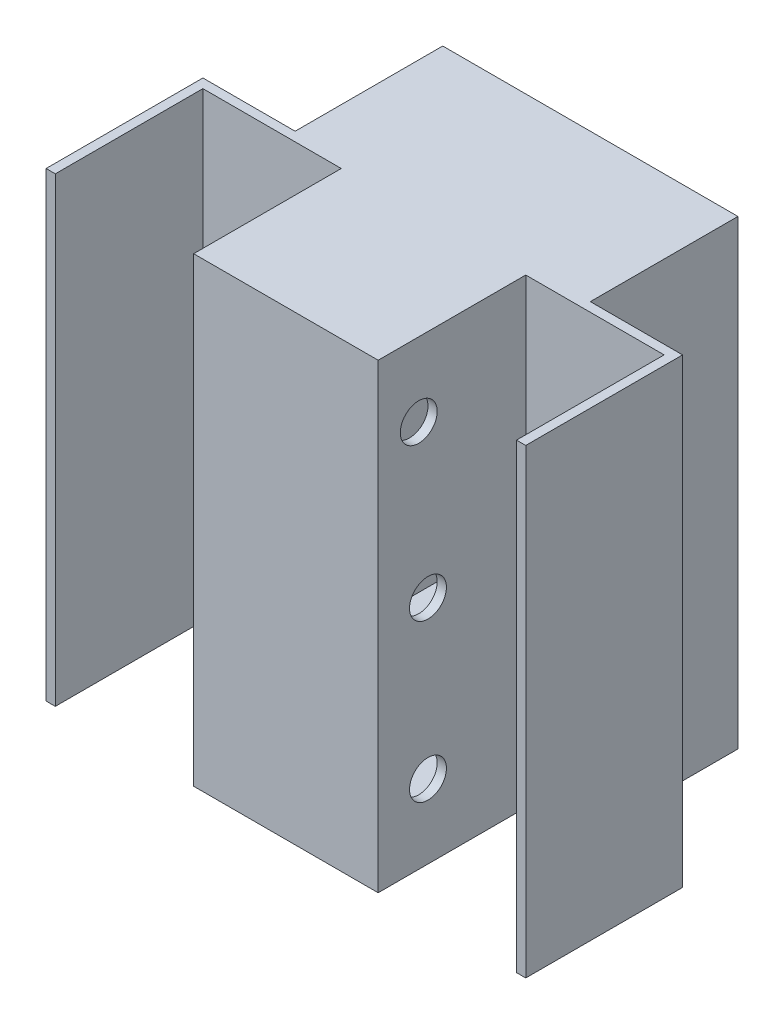
ISO-10303-21;
HEADER;
FILE_DESCRIPTION(('STEP AP214'),'2;1');
FILE_NAME('part.step','',(''),(''),'','','');
FILE_SCHEMA(('AUTOMOTIVE_DESIGN { 1 0 10303 214 1 1 1 1 }'));
ENDSEC;
DATA;
#1=APPLICATION_CONTEXT('core data for automotive mechanical design processes');
#2=APPLICATION_PROTOCOL_DEFINITION('international standard','automotive_design',2000,#1);
#3=PRODUCT_CONTEXT('',#1,'mechanical');
#4=PRODUCT('Part','Part','',(#3));
#5=PRODUCT_RELATED_PRODUCT_CATEGORY('part','',(#4));
#6=PRODUCT_DEFINITION_FORMATION('','',#4);
#7=PRODUCT_DEFINITION_CONTEXT('part definition',#1,'design');
#8=PRODUCT_DEFINITION('design','',#6,#7);
#9=PRODUCT_DEFINITION_SHAPE('','',#8);
#10=(LENGTH_UNIT() NAMED_UNIT(*) SI_UNIT(.MILLI.,.METRE.));
#11=(NAMED_UNIT(*) PLANE_ANGLE_UNIT() SI_UNIT($,.RADIAN.));
#12=(NAMED_UNIT(*) SI_UNIT($,.STERADIAN.) SOLID_ANGLE_UNIT());
#13=UNCERTAINTY_MEASURE_WITH_UNIT(LENGTH_MEASURE(1.E-05),#10,'distance_accuracy_value','');
#14=(GEOMETRIC_REPRESENTATION_CONTEXT(3) GLOBAL_UNCERTAINTY_ASSIGNED_CONTEXT((#13)) GLOBAL_UNIT_ASSIGNED_CONTEXT((#10,
#11,#12)) REPRESENTATION_CONTEXT('',''));
#15=CARTESIAN_POINT('',(0.,0.,0.));
#16=DIRECTION('',(0.,0.,1.));
#17=DIRECTION('',(1.,0.,0.));
#18=AXIS2_PLACEMENT_3D('',#15,#16,#17);
#19=CARTESIAN_POINT('',(-90.,0.,0.));
#20=DIRECTION('',(-1.,0.,0.));
#21=DIRECTION('',(0.,0.,-1.));
#22=AXIS2_PLACEMENT_3D('',#19,#20,#21);
#23=PLANE('',#22);
#24=CARTESIAN_POINT('',(-90.,210.,-17.));
#25=DIRECTION('',(1.,0.,0.));
#26=DIRECTION('',(0.,0.,-1.));
#27=AXIS2_PLACEMENT_3D('',#24,#25,#26);
#28=CIRCLE('',#27,10.);
#29=CARTESIAN_POINT('',(-90.,210.,-27.));
#30=VERTEX_POINT('',#29);
#31=EDGE_CURVE('E278',#30,#30,#28,.T.);
#32=ORIENTED_EDGE('',*,*,#31,.F.);
#33=EDGE_LOOP('',(#32));
#34=FACE_BOUND('',#33,.T.);
#35=CARTESIAN_POINT('',(-90.,40.,-22.));
#36=DIRECTION('',(1.,0.,0.));
#37=DIRECTION('',(0.,0.,-1.));
#38=AXIS2_PLACEMENT_3D('',#35,#36,#37);
#39=CIRCLE('',#38,10.);
#40=CARTESIAN_POINT('',(-90.,40.,-32.));
#41=VERTEX_POINT('',#40);
#42=EDGE_CURVE('E290',#41,#41,#39,.T.);
#43=ORIENTED_EDGE('',*,*,#42,.F.);
#44=EDGE_LOOP('',(#43));
#45=FACE_BOUND('',#44,.T.);
#46=CARTESIAN_POINT('',(-90.,125.,-22.));
#47=DIRECTION('',(1.,0.,0.));
#48=DIRECTION('',(0.,0.,-1.));
#49=AXIS2_PLACEMENT_3D('',#46,#47,#48);
#50=CIRCLE('',#49,10.);
#51=CARTESIAN_POINT('',(-90.,125.,-32.));
#52=VERTEX_POINT('',#51);
#53=EDGE_CURVE('E284',#52,#52,#50,.T.);
#54=ORIENTED_EDGE('',*,*,#53,.F.);
#55=EDGE_LOOP('',(#54));
#56=FACE_BOUND('',#55,.T.);
#57=DIRECTION('',(0.,1.,0.));
#58=VECTOR('',#57,1.);
#59=CARTESIAN_POINT('',(-90.,250.,-80.));
#60=LINE('',#59,#58);
#61=CARTESIAN_POINT('',(-90.,5.,-80.));
#62=VERTEX_POINT('',#61);
#63=CARTESIAN_POINT('',(-90.,245.,-80.));
#64=VERTEX_POINT('',#63);
#65=EDGE_CURVE('E269',#62,#64,#60,.T.);
#66=ORIENTED_EDGE('',*,*,#65,.T.);
#67=DIRECTION('',(0.,0.,1.));
#68=VECTOR('',#67,1.);
#69=CARTESIAN_POINT('',(-90.,245.,-80.));
#70=LINE('',#69,#68);
#71=CARTESIAN_POINT('',(-90.,245.,0.));
#72=VERTEX_POINT('',#71);
#73=EDGE_CURVE('E52',#64,#72,#70,.T.);
#74=ORIENTED_EDGE('',*,*,#73,.T.);
#75=DIRECTION('',(0.,1.,0.));
#76=VECTOR('',#75,1.);
#77=CARTESIAN_POINT('',(-90.,0.,0.));
#78=LINE('',#77,#76);
#79=CARTESIAN_POINT('',(-90.,5.,0.));
#80=VERTEX_POINT('',#79);
#81=EDGE_CURVE('E387',#80,#72,#78,.T.);
#82=ORIENTED_EDGE('',*,*,#81,.F.);
#83=DIRECTION('',(0.,0.,-1.));
#84=VECTOR('',#83,1.);
#85=CARTESIAN_POINT('',(-90.,5.,0.));
#86=LINE('',#85,#84);
#87=EDGE_CURVE('E251',#80,#62,#86,.T.);
#88=ORIENTED_EDGE('',*,*,#87,.T.);
#89=EDGE_LOOP('',(#66,#74,#82,#88));
#90=FACE_BOUND('',#89,.T.);
#91=ADVANCED_FACE('F35',(#34,#45,#56,#90),#23,.F.);
#92=CARTESIAN_POINT('',(0.,0.,-80.));
#93=DIRECTION('',(0.,0.,1.));
#94=DIRECTION('',(0.,-1.,0.));
#95=AXIS2_PLACEMENT_3D('',#92,#93,#94);
#96=PLANE('',#95);
#97=DIRECTION('',(0.,1.,0.));
#98=VECTOR('',#97,1.);
#99=CARTESIAN_POINT('',(0.,250.,-80.));
#100=LINE('',#99,#98);
#101=CARTESIAN_POINT('',(0.,5.,-80.));
#102=VERTEX_POINT('',#101);
#103=CARTESIAN_POINT('',(0.,245.,-80.));
#104=VERTEX_POINT('',#103);
#105=EDGE_CURVE('E401',#102,#104,#100,.T.);
#106=ORIENTED_EDGE('',*,*,#105,.T.);
#107=DIRECTION('',(1.,0.,0.));
#108=VECTOR('',#107,1.);
#109=CARTESIAN_POINT('',(0.,245.,-80.));
#110=LINE('',#109,#108);
#111=CARTESIAN_POINT('',(30.,245.,-80.));
#112=VERTEX_POINT('',#111);
#113=EDGE_CURVE('E360',#104,#112,#110,.T.);
#114=ORIENTED_EDGE('',*,*,#113,.T.);
#115=DIRECTION('',(0.,1.,0.));
#116=VECTOR('',#115,1.);
#117=CARTESIAN_POINT('',(30.,250.,-80.));
#118=LINE('',#117,#116);
#119=CARTESIAN_POINT('',(30.,5.,-80.));
#120=VERTEX_POINT('',#119);
#121=EDGE_CURVE('E393',#120,#112,#118,.T.);
#122=ORIENTED_EDGE('',*,*,#121,.F.);
#123=DIRECTION('',(-1.,0.,0.));
#124=VECTOR('',#123,1.);
#125=CARTESIAN_POINT('',(30.,5.00000000000001,-80.));
#126=LINE('',#125,#124);
#127=EDGE_CURVE('E233',#120,#102,#126,.T.);
#128=ORIENTED_EDGE('',*,*,#127,.T.);
#129=EDGE_LOOP('',(#106,#114,#122,#128));
#130=FACE_BOUND('',#129,.T.);
#131=ADVANCED_FACE('F515',(#130),#96,.F.);
#132=CARTESIAN_POINT('',(0.,0.,0.));
#133=DIRECTION('',(0.,0.,1.));
#134=DIRECTION('',(1.,0.,0.));
#135=AXIS2_PLACEMENT_3D('',#132,#133,#134);
#136=PLANE('',#135);
#137=ORIENTED_EDGE('',*,*,#81,.T.);
#138=DIRECTION('',(1.,0.,0.));
#139=VECTOR('',#138,1.);
#140=CARTESIAN_POINT('',(-90.,245.,0.));
#141=LINE('',#140,#139);
#142=CARTESIAN_POINT('',(0.,245.,0.));
#143=VERTEX_POINT('',#142);
#144=EDGE_CURVE('E347',#72,#143,#141,.T.);
#145=ORIENTED_EDGE('',*,*,#144,.T.);
#146=DIRECTION('',(0.,1.,0.));
#147=VECTOR('',#146,1.);
#148=CARTESIAN_POINT('',(0.,0.,0.));
#149=LINE('',#148,#147);
#150=CARTESIAN_POINT('',(0.,5.,0.));
#151=VERTEX_POINT('',#150);
#152=EDGE_CURVE('E388',#151,#143,#149,.T.);
#153=ORIENTED_EDGE('',*,*,#152,.F.);
#154=DIRECTION('',(-1.,0.,0.));
#155=VECTOR('',#154,1.);
#156=CARTESIAN_POINT('',(0.,5.,0.));
#157=LINE('',#156,#155);
#158=EDGE_CURVE('E247',#151,#80,#157,.T.);
#159=ORIENTED_EDGE('',*,*,#158,.T.);
#160=EDGE_LOOP('',(#137,#145,#153,#159));
#161=FACE_BOUND('',#160,.T.);
#162=ADVANCED_FACE('F386',(#161),#136,.F.);
#163=CARTESIAN_POINT('',(0.,0.,0.));
#164=DIRECTION('',(1.,0.,0.));
#165=DIRECTION('',(0.,0.,-1.));
#166=AXIS2_PLACEMENT_3D('',#163,#164,#165);
#167=PLANE('',#166);
#168=CARTESIAN_POINT('',(0.,40.,-22.));
#169=DIRECTION('',(1.,0.,0.));
#170=DIRECTION('',(0.,0.,-1.));
#171=AXIS2_PLACEMENT_3D('',#168,#169,#170);
#172=CIRCLE('',#171,10.);
#173=CARTESIAN_POINT('',(0.,40.,-32.));
#174=VERTEX_POINT('',#173);
#175=EDGE_CURVE('E436',#174,#174,#172,.T.);
#176=ORIENTED_EDGE('',*,*,#175,.T.);
#177=EDGE_LOOP('',(#176));
#178=FACE_BOUND('',#177,.T.);
#179=CARTESIAN_POINT('',(0.,125.,-22.));
#180=DIRECTION('',(1.,0.,0.));
#181=DIRECTION('',(0.,0.,-1.));
#182=AXIS2_PLACEMENT_3D('',#179,#180,#181);
#183=CIRCLE('',#182,10.);
#184=CARTESIAN_POINT('',(0.,125.,-32.));
#185=VERTEX_POINT('',#184);
#186=EDGE_CURVE('E430',#185,#185,#183,.T.);
#187=ORIENTED_EDGE('',*,*,#186,.T.);
#188=EDGE_LOOP('',(#187));
#189=FACE_BOUND('',#188,.T.);
#190=CARTESIAN_POINT('',(0.,210.,-17.));
#191=DIRECTION('',(1.,0.,0.));
#192=DIRECTION('',(0.,0.,-1.));
#193=AXIS2_PLACEMENT_3D('',#190,#191,#192);
#194=CIRCLE('',#193,10.);
#195=CARTESIAN_POINT('',(0.,210.,-27.));
#196=VERTEX_POINT('',#195);
#197=EDGE_CURVE('E422',#196,#196,#194,.T.);
#198=ORIENTED_EDGE('',*,*,#197,.T.);
#199=EDGE_LOOP('',(#198));
#200=FACE_BOUND('',#199,.T.);
#201=ORIENTED_EDGE('',*,*,#152,.T.);
#202=DIRECTION('',(0.,0.,-1.));
#203=VECTOR('',#202,1.);
#204=CARTESIAN_POINT('',(0.,245.,0.));
#205=LINE('',#204,#203);
#206=EDGE_CURVE('E60',#143,#104,#205,.T.);
#207=ORIENTED_EDGE('',*,*,#206,.T.);
#208=ORIENTED_EDGE('',*,*,#105,.F.);
#209=DIRECTION('',(0.,0.,1.));
#210=VECTOR('',#209,1.);
#211=CARTESIAN_POINT('',(0.,5.00000000000001,-80.));
#212=LINE('',#211,#210);
#213=EDGE_CURVE('E243',#102,#151,#212,.T.);
#214=ORIENTED_EDGE('',*,*,#213,.T.);
#215=EDGE_LOOP('',(#201,#207,#208,#214));
#216=FACE_BOUND('',#215,.T.);
#217=ADVANCED_FACE('F530',(#178,#189,#200,#216),#167,.F.);
#218=CARTESIAN_POINT('',(30.,250.,-160.));
#219=DIRECTION('',(1.,0.,0.));
#220=DIRECTION('',(0.,1.,0.));
#221=AXIS2_PLACEMENT_3D('',#218,#219,#220);
#222=PLANE('',#221);
#223=ORIENTED_EDGE('',*,*,#121,.T.);
#224=DIRECTION('',(0.,0.,-1.));
#225=VECTOR('',#224,1.);
#226=CARTESIAN_POINT('',(30.,245.,-80.));
#227=LINE('',#226,#225);
#228=CARTESIAN_POINT('',(30.,245.,-160.));
#229=VERTEX_POINT('',#228);
#230=EDGE_CURVE('E364',#112,#229,#227,.T.);
#231=ORIENTED_EDGE('',*,*,#230,.T.);
#232=DIRECTION('',(0.,1.,0.));
#233=VECTOR('',#232,1.);
#234=CARTESIAN_POINT('',(30.,250.,-160.));
#235=LINE('',#234,#233);
#236=CARTESIAN_POINT('',(30.,5.,-160.));
#237=VERTEX_POINT('',#236);
#238=EDGE_CURVE('E416',#237,#229,#235,.T.);
#239=ORIENTED_EDGE('',*,*,#238,.F.);
#240=DIRECTION('',(0.,0.,1.));
#241=VECTOR('',#240,1.);
#242=CARTESIAN_POINT('',(30.,5.,-160.));
#243=LINE('',#242,#241);
#244=EDGE_CURVE('E228',#237,#120,#243,.T.);
#245=ORIENTED_EDGE('',*,*,#244,.T.);
#246=EDGE_LOOP('',(#223,#231,#239,#245));
#247=FACE_BOUND('',#246,.T.);
#248=ADVANCED_FACE('F527',(#247),#222,.F.);
#249=CARTESIAN_POINT('',(-90.,0.,-80.));
#250=DIRECTION('',(0.,0.,1.));
#251=DIRECTION('',(0.,-1.,0.));
#252=AXIS2_PLACEMENT_3D('',#249,#250,#251);
#253=PLANE('',#252);
#254=DIRECTION('',(0.,1.,0.));
#255=VECTOR('',#254,1.);
#256=CARTESIAN_POINT('',(-120.,250.,-80.));
#257=LINE('',#256,#255);
#258=CARTESIAN_POINT('',(-120.,5.,-80.));
#259=VERTEX_POINT('',#258);
#260=CARTESIAN_POINT('',(-120.,245.,-80.));
#261=VERTEX_POINT('',#260);
#262=EDGE_CURVE('E221',#259,#261,#257,.T.);
#263=ORIENTED_EDGE('',*,*,#262,.T.);
#264=DIRECTION('',(1.,0.,0.));
#265=VECTOR('',#264,1.);
#266=CARTESIAN_POINT('',(-120.,245.,-80.));
#267=LINE('',#266,#265);
#268=EDGE_CURVE('E346',#261,#64,#267,.T.);
#269=ORIENTED_EDGE('',*,*,#268,.T.);
#270=ORIENTED_EDGE('',*,*,#65,.F.);
#271=DIRECTION('',(-1.,0.,0.));
#272=VECTOR('',#271,1.);
#273=CARTESIAN_POINT('',(-90.,5.00000000000001,-80.));
#274=LINE('',#273,#272);
#275=EDGE_CURVE('E224',#62,#259,#274,.T.);
#276=ORIENTED_EDGE('',*,*,#275,.T.);
#277=EDGE_LOOP('',(#263,#269,#270,#276));
#278=FACE_BOUND('',#277,.T.);
#279=ADVANCED_FACE('F381',(#278),#253,.F.);
#280=CARTESIAN_POINT('',(-120.,250.,-160.));
#281=DIRECTION('',(1.,0.,0.));
#282=DIRECTION('',(0.,1.,0.));
#283=AXIS2_PLACEMENT_3D('',#280,#281,#282);
#284=PLANE('',#283);
#285=DIRECTION('',(0.,0.,1.));
#286=VECTOR('',#285,1.);
#287=CARTESIAN_POINT('',(-120.,245.,-160.));
#288=LINE('',#287,#286);
#289=CARTESIAN_POINT('',(-120.,245.,-160.));
#290=VERTEX_POINT('',#289);
#291=EDGE_CURVE('E349',#290,#261,#288,.T.);
#292=ORIENTED_EDGE('',*,*,#291,.T.);
#293=ORIENTED_EDGE('',*,*,#262,.F.);
#294=DIRECTION('',(0.,0.,-1.));
#295=VECTOR('',#294,1.);
#296=CARTESIAN_POINT('',(-120.,5.00000000000001,-80.));
#297=LINE('',#296,#295);
#298=CARTESIAN_POINT('',(-120.,5.,-160.));
#299=VERTEX_POINT('',#298);
#300=EDGE_CURVE('E218',#259,#299,#297,.T.);
#301=ORIENTED_EDGE('',*,*,#300,.T.);
#302=DIRECTION('',(0.,1.,0.));
#303=VECTOR('',#302,1.);
#304=CARTESIAN_POINT('',(-120.,250.,-160.));
#305=LINE('',#304,#303);
#306=EDGE_CURVE('E201',#299,#290,#305,.T.);
#307=ORIENTED_EDGE('',*,*,#306,.T.);
#308=EDGE_LOOP('',(#292,#293,#301,#307));
#309=FACE_BOUND('',#308,.T.);
#310=ADVANCED_FACE('F219',(#309),#284,.T.);
#311=DIRECTION('',(-1.,0.,0.));
#312=VECTOR('',#311,1.);
#313=CARTESIAN_POINT('',(-90.,250.,-80.));
#314=LINE('',#313,#312);
#315=CARTESIAN_POINT('',(-125.,250.,-80.));
#316=VERTEX_POINT('',#315);
#317=CARTESIAN_POINT('',(-175.,250.,-80.));
#318=VERTEX_POINT('',#317);
#319=EDGE_CURVE('E322',#316,#318,#314,.T.);
#320=ORIENTED_EDGE('',*,*,#319,.F.);
#321=DIRECTION('',(0.,-1.,0.));
#322=VECTOR('',#321,1.);
#323=CARTESIAN_POINT('',(-125.,250.,-80.));
#324=LINE('',#323,#322);
#325=CARTESIAN_POINT('',(-125.,0.,-80.));
#326=VERTEX_POINT('',#325);
#327=EDGE_CURVE('E229',#316,#326,#324,.T.);
#328=ORIENTED_EDGE('',*,*,#327,.T.);
#329=DIRECTION('',(1.,0.,0.));
#330=VECTOR('',#329,1.);
#331=CARTESIAN_POINT('',(-90.,0.,-80.));
#332=LINE('',#331,#330);
#333=CARTESIAN_POINT('',(-175.,0.,-80.));
#334=VERTEX_POINT('',#333);
#335=EDGE_CURVE('E319',#334,#326,#332,.T.);
#336=ORIENTED_EDGE('',*,*,#335,.F.);
#337=DIRECTION('',(0.,1.,0.));
#338=VECTOR('',#337,1.);
#339=CARTESIAN_POINT('',(-175.,250.,-80.));
#340=LINE('',#339,#338);
#341=EDGE_CURVE('E296',#334,#318,#340,.T.);
#342=ORIENTED_EDGE('',*,*,#341,.T.);
#343=EDGE_LOOP('',(#320,#328,#336,#342));
#344=FACE_BOUND('',#343,.T.);
#345=ADVANCED_FACE('F649',(#344),#253,.F.);
#346=CARTESIAN_POINT('',(-95.,0.,0.));
#347=DIRECTION('',(-1.,0.,0.));
#348=DIRECTION('',(0.,0.,-1.));
#349=AXIS2_PLACEMENT_3D('',#346,#347,#348);
#350=PLANE('',#349);
#351=CARTESIAN_POINT('',(-95.,125.,-22.));
#352=DIRECTION('',(1.,0.,0.));
#353=DIRECTION('',(0.,0.,-1.));
#354=AXIS2_PLACEMENT_3D('',#351,#352,#353);
#355=CIRCLE('',#354,10.);
#356=CARTESIAN_POINT('',(-95.,125.,-32.));
#357=VERTEX_POINT('',#356);
#358=EDGE_CURVE('E281',#357,#357,#355,.T.);
#359=ORIENTED_EDGE('',*,*,#358,.T.);
#360=EDGE_LOOP('',(#359));
#361=FACE_BOUND('',#360,.T.);
#362=DIRECTION('',(0.,-1.,0.));
#363=VECTOR('',#362,1.);
#364=CARTESIAN_POINT('',(-95.,250.,5.));
#365=LINE('',#364,#363);
#366=CARTESIAN_POINT('',(-95.,250.,5.));
#367=VERTEX_POINT('',#366);
#368=CARTESIAN_POINT('',(-95.,0.,5.));
#369=VERTEX_POINT('',#368);
#370=EDGE_CURVE('E324',#367,#369,#365,.T.);
#371=ORIENTED_EDGE('',*,*,#370,.F.);
#372=DIRECTION('',(0.,0.,1.));
#373=VECTOR('',#372,1.);
#374=CARTESIAN_POINT('',(-95.,250.,5.));
#375=LINE('',#374,#373);
#376=CARTESIAN_POINT('',(-95.,250.,-75.));
#377=VERTEX_POINT('',#376);
#378=EDGE_CURVE('E646',#377,#367,#375,.T.);
#379=ORIENTED_EDGE('',*,*,#378,.F.);
#380=DIRECTION('',(0.,1.,0.));
#381=VECTOR('',#380,1.);
#382=CARTESIAN_POINT('',(-95.,250.,-75.));
#383=LINE('',#382,#381);
#384=CARTESIAN_POINT('',(-95.,0.,-75.));
#385=VERTEX_POINT('',#384);
#386=EDGE_CURVE('E396',#385,#377,#383,.T.);
#387=ORIENTED_EDGE('',*,*,#386,.F.);
#388=DIRECTION('',(0.,0.,-1.));
#389=VECTOR('',#388,1.);
#390=CARTESIAN_POINT('',(-95.,0.,5.));
#391=LINE('',#390,#389);
#392=EDGE_CURVE('E390',#369,#385,#391,.T.);
#393=ORIENTED_EDGE('',*,*,#392,.F.);
#394=EDGE_LOOP('',(#371,#379,#387,#393));
#395=FACE_BOUND('',#394,.T.);
#396=CARTESIAN_POINT('',(-95.,40.,-22.));
#397=DIRECTION('',(1.,0.,0.));
#398=DIRECTION('',(0.,0.,-1.));
#399=AXIS2_PLACEMENT_3D('',#396,#397,#398);
#400=CIRCLE('',#399,10.);
#401=CARTESIAN_POINT('',(-95.,40.,-32.));
#402=VERTEX_POINT('',#401);
#403=EDGE_CURVE('E287',#402,#402,#400,.T.);
#404=ORIENTED_EDGE('',*,*,#403,.T.);
#405=EDGE_LOOP('',(#404));
#406=FACE_BOUND('',#405,.T.);
#407=CARTESIAN_POINT('',(-95.,210.,-17.));
#408=DIRECTION('',(1.,0.,0.));
#409=DIRECTION('',(0.,0.,-1.));
#410=AXIS2_PLACEMENT_3D('',#407,#408,#409);
#411=CIRCLE('',#410,10.);
#412=CARTESIAN_POINT('',(-95.,210.,-27.));
#413=VERTEX_POINT('',#412);
#414=EDGE_CURVE('E277',#413,#413,#411,.T.);
#415=ORIENTED_EDGE('',*,*,#414,.T.);
#416=EDGE_LOOP('',(#415));
#417=FACE_BOUND('',#416,.T.);
#418=ADVANCED_FACE('F525',(#361,#395,#406,#417),#350,.T.);
#419=DIRECTION('',(0.,-1.,0.));
#420=VECTOR('',#419,1.);
#421=CARTESIAN_POINT('',(35.,250.,-80.));
#422=LINE('',#421,#420);
#423=CARTESIAN_POINT('',(35.,250.,-80.));
#424=VERTEX_POINT('',#423);
#425=CARTESIAN_POINT('',(35.,0.,-80.));
#426=VERTEX_POINT('',#425);
#427=EDGE_CURVE('E389',#424,#426,#422,.T.);
#428=ORIENTED_EDGE('',*,*,#427,.F.);
#429=DIRECTION('',(1.,0.,0.));
#430=VECTOR('',#429,1.);
#431=CARTESIAN_POINT('',(0.,250.,-80.));
#432=LINE('',#431,#430);
#433=CARTESIAN_POINT('',(85.,250.,-80.));
#434=VERTEX_POINT('',#433);
#435=EDGE_CURVE('E468',#424,#434,#432,.T.);
#436=ORIENTED_EDGE('',*,*,#435,.T.);
#437=DIRECTION('',(0.,1.,0.));
#438=VECTOR('',#437,1.);
#439=CARTESIAN_POINT('',(85.,250.,-80.));
#440=LINE('',#439,#438);
#441=CARTESIAN_POINT('',(85.,0.,-80.));
#442=VERTEX_POINT('',#441);
#443=EDGE_CURVE('E442',#442,#434,#440,.T.);
#444=ORIENTED_EDGE('',*,*,#443,.F.);
#445=DIRECTION('',(-1.,0.,0.));
#446=VECTOR('',#445,1.);
#447=CARTESIAN_POINT('',(0.,0.,-80.));
#448=LINE('',#447,#446);
#449=EDGE_CURVE('E471',#442,#426,#448,.T.);
#450=ORIENTED_EDGE('',*,*,#449,.T.);
#451=EDGE_LOOP('',(#428,#436,#444,#450));
#452=FACE_BOUND('',#451,.T.);
#453=ADVANCED_FACE('F522',(#452),#96,.F.);
#454=CARTESIAN_POINT('',(0.,250.,5.));
#455=DIRECTION('',(0.,-1.,0.));
#456=DIRECTION('',(0.,0.,-1.));
#457=AXIS2_PLACEMENT_3D('',#454,#455,#456);
#458=PLANE('',#457);
#459=DIRECTION('',(1.,0.,0.));
#460=VECTOR('',#459,1.);
#461=CARTESIAN_POINT('',(35.,250.,-160.));
#462=LINE('',#461,#460);
#463=CARTESIAN_POINT('',(-125.,250.,-160.));
#464=VERTEX_POINT('',#463);
#465=CARTESIAN_POINT('',(35.,250.,-160.));
#466=VERTEX_POINT('',#465);
#467=EDGE_CURVE('E418',#464,#466,#462,.T.);
#468=ORIENTED_EDGE('',*,*,#467,.F.);
#469=DIRECTION('',(0.,0.,1.));
#470=VECTOR('',#469,1.);
#471=CARTESIAN_POINT('',(-125.,250.,-160.));
#472=LINE('',#471,#470);
#473=EDGE_CURVE('E275',#464,#316,#472,.T.);
#474=ORIENTED_EDGE('',*,*,#473,.T.);
#475=ORIENTED_EDGE('',*,*,#319,.T.);
#476=DIRECTION('',(0.,0.,1.));
#477=VECTOR('',#476,1.);
#478=CARTESIAN_POINT('',(-175.,250.,-80.));
#479=LINE('',#478,#477);
#480=CARTESIAN_POINT('',(-175.,250.,5.));
#481=VERTEX_POINT('',#480);
#482=EDGE_CURVE('E306',#318,#481,#479,.T.);
#483=ORIENTED_EDGE('',*,*,#482,.T.);
#484=DIRECTION('',(1.,0.,0.));
#485=VECTOR('',#484,1.);
#486=CARTESIAN_POINT('',(-175.,250.,5.));
#487=LINE('',#486,#485);
#488=CARTESIAN_POINT('',(-170.,250.,5.));
#489=VERTEX_POINT('',#488);
#490=EDGE_CURVE('E309',#481,#489,#487,.T.);
#491=ORIENTED_EDGE('',*,*,#490,.T.);
#492=DIRECTION('',(0.,0.,1.));
#493=VECTOR('',#492,1.);
#494=CARTESIAN_POINT('',(-170.,250.,-80.));
#495=LINE('',#494,#493);
#496=CARTESIAN_POINT('',(-170.,250.,-75.));
#497=VERTEX_POINT('',#496);
#498=EDGE_CURVE('E300',#497,#489,#495,.T.);
#499=ORIENTED_EDGE('',*,*,#498,.F.);
#500=DIRECTION('',(-1.,0.,0.));
#501=VECTOR('',#500,1.);
#502=CARTESIAN_POINT('',(-90.,250.,-75.));
#503=LINE('',#502,#501);
#504=EDGE_CURVE('E332',#377,#497,#503,.T.);
#505=ORIENTED_EDGE('',*,*,#504,.F.);
#506=ORIENTED_EDGE('',*,*,#378,.T.);
#507=DIRECTION('',(-1.,0.,0.));
#508=VECTOR('',#507,1.);
#509=CARTESIAN_POINT('',(0.,250.,5.));
#510=LINE('',#509,#508);
#511=CARTESIAN_POINT('',(5.,250.,5.));
#512=VERTEX_POINT('',#511);
#513=EDGE_CURVE('E44',#512,#367,#510,.T.);
#514=ORIENTED_EDGE('',*,*,#513,.F.);
#515=DIRECTION('',(0.,0.,1.));
#516=VECTOR('',#515,1.);
#517=CARTESIAN_POINT('',(5.,250.,5.));
#518=LINE('',#517,#516);
#519=CARTESIAN_POINT('',(5.,250.,-75.));
#520=VERTEX_POINT('',#519);
#521=EDGE_CURVE('E629',#520,#512,#518,.T.);
#522=ORIENTED_EDGE('',*,*,#521,.F.);
#523=DIRECTION('',(1.,0.,0.));
#524=VECTOR('',#523,1.);
#525=CARTESIAN_POINT('',(0.,250.,-75.));
#526=LINE('',#525,#524);
#527=CARTESIAN_POINT('',(80.,250.,-75.));
#528=VERTEX_POINT('',#527);
#529=EDGE_CURVE('E603',#520,#528,#526,.T.);
#530=ORIENTED_EDGE('',*,*,#529,.T.);
#531=DIRECTION('',(0.,0.,1.));
#532=VECTOR('',#531,1.);
#533=CARTESIAN_POINT('',(80.,250.,-80.));
#534=LINE('',#533,#532);
#535=CARTESIAN_POINT('',(80.,250.,5.));
#536=VERTEX_POINT('',#535);
#537=EDGE_CURVE('E439',#528,#536,#534,.T.);
#538=ORIENTED_EDGE('',*,*,#537,.T.);
#539=DIRECTION('',(-1.,0.,0.));
#540=VECTOR('',#539,1.);
#541=CARTESIAN_POINT('',(85.,250.,5.));
#542=LINE('',#541,#540);
#543=CARTESIAN_POINT('',(85.,250.,5.));
#544=VERTEX_POINT('',#543);
#545=EDGE_CURVE('E600',#544,#536,#542,.T.);
#546=ORIENTED_EDGE('',*,*,#545,.F.);
#547=DIRECTION('',(0.,0.,1.));
#548=VECTOR('',#547,1.);
#549=CARTESIAN_POINT('',(85.,250.,-80.));
#550=LINE('',#549,#548);
#551=EDGE_CURVE('E445',#434,#544,#550,.T.);
#552=ORIENTED_EDGE('',*,*,#551,.F.);
#553=ORIENTED_EDGE('',*,*,#435,.F.);
#554=DIRECTION('',(0.,0.,1.));
#555=VECTOR('',#554,1.);
#556=CARTESIAN_POINT('',(35.,250.,-160.));
#557=LINE('',#556,#555);
#558=EDGE_CURVE('E479',#466,#424,#557,.T.);
#559=ORIENTED_EDGE('',*,*,#558,.F.);
#560=EDGE_LOOP('',(#468,#474,#475,#483,#491,#499,#505,#506,#514,#522,#530,#538,#546,#552,#553,#559));
#561=FACE_BOUND('',#560,.T.);
#562=ADVANCED_FACE('F37',(#561),#458,.F.);
#563=CARTESIAN_POINT('',(0.,0.,5.));
#564=DIRECTION('',(0.,1.,0.));
#565=DIRECTION('',(-1.,0.,0.));
#566=AXIS2_PLACEMENT_3D('',#563,#564,#565);
#567=PLANE('',#566);
#568=DIRECTION('',(0.,0.,1.));
#569=VECTOR('',#568,1.);
#570=CARTESIAN_POINT('',(-125.,0.,-160.));
#571=LINE('',#570,#569);
#572=CARTESIAN_POINT('',(-125.,0.,-160.));
#573=VERTEX_POINT('',#572);
#574=EDGE_CURVE('E213',#573,#326,#571,.T.);
#575=ORIENTED_EDGE('',*,*,#574,.F.);
#576=DIRECTION('',(-1.,0.,0.));
#577=VECTOR('',#576,1.);
#578=CARTESIAN_POINT('',(35.,0.,-160.));
#579=LINE('',#578,#577);
#580=CARTESIAN_POINT('',(35.,0.,-160.));
#581=VERTEX_POINT('',#580);
#582=EDGE_CURVE('E404',#581,#573,#579,.T.);
#583=ORIENTED_EDGE('',*,*,#582,.F.);
#584=DIRECTION('',(0.,0.,1.));
#585=VECTOR('',#584,1.);
#586=CARTESIAN_POINT('',(35.,0.,-160.));
#587=LINE('',#586,#585);
#588=EDGE_CURVE('E429',#581,#426,#587,.T.);
#589=ORIENTED_EDGE('',*,*,#588,.T.);
#590=ORIENTED_EDGE('',*,*,#449,.F.);
#591=DIRECTION('',(0.,0.,-1.));
#592=VECTOR('',#591,1.);
#593=CARTESIAN_POINT('',(85.,0.,-80.));
#594=LINE('',#593,#592);
#595=CARTESIAN_POINT('',(85.,0.,5.));
#596=VERTEX_POINT('',#595);
#597=EDGE_CURVE('E450',#596,#442,#594,.T.);
#598=ORIENTED_EDGE('',*,*,#597,.F.);
#599=DIRECTION('',(-1.,0.,0.));
#600=VECTOR('',#599,1.);
#601=CARTESIAN_POINT('',(85.,0.,5.));
#602=LINE('',#601,#600);
#603=CARTESIAN_POINT('',(80.,0.,5.));
#604=VERTEX_POINT('',#603);
#605=EDGE_CURVE('E453',#596,#604,#602,.T.);
#606=ORIENTED_EDGE('',*,*,#605,.T.);
#607=DIRECTION('',(0.,0.,-1.));
#608=VECTOR('',#607,1.);
#609=CARTESIAN_POINT('',(80.,0.,-80.));
#610=LINE('',#609,#608);
#611=CARTESIAN_POINT('',(80.,0.,-75.));
#612=VERTEX_POINT('',#611);
#613=EDGE_CURVE('E446',#604,#612,#610,.T.);
#614=ORIENTED_EDGE('',*,*,#613,.T.);
#615=DIRECTION('',(-1.,0.,0.));
#616=VECTOR('',#615,1.);
#617=CARTESIAN_POINT('',(0.,0.,-75.));
#618=LINE('',#617,#616);
#619=CARTESIAN_POINT('',(5.,0.,-75.));
#620=VERTEX_POINT('',#619);
#621=EDGE_CURVE('E611',#612,#620,#618,.T.);
#622=ORIENTED_EDGE('',*,*,#621,.T.);
#623=DIRECTION('',(0.,0.,-1.));
#624=VECTOR('',#623,1.);
#625=CARTESIAN_POINT('',(5.,0.,5.));
#626=LINE('',#625,#624);
#627=CARTESIAN_POINT('',(5.,0.,5.));
#628=VERTEX_POINT('',#627);
#629=EDGE_CURVE('E622',#628,#620,#626,.T.);
#630=ORIENTED_EDGE('',*,*,#629,.F.);
#631=DIRECTION('',(1.,0.,0.));
#632=VECTOR('',#631,1.);
#633=CARTESIAN_POINT('',(0.,0.,5.));
#634=LINE('',#633,#632);
#635=EDGE_CURVE('E12',#369,#628,#634,.T.);
#636=ORIENTED_EDGE('',*,*,#635,.F.);
#637=ORIENTED_EDGE('',*,*,#392,.T.);
#638=DIRECTION('',(1.,0.,0.));
#639=VECTOR('',#638,1.);
#640=CARTESIAN_POINT('',(-90.,0.,-75.));
#641=LINE('',#640,#639);
#642=CARTESIAN_POINT('',(-170.,0.,-75.));
#643=VERTEX_POINT('',#642);
#644=EDGE_CURVE('E333',#643,#385,#641,.T.);
#645=ORIENTED_EDGE('',*,*,#644,.F.);
#646=DIRECTION('',(0.,0.,-1.));
#647=VECTOR('',#646,1.);
#648=CARTESIAN_POINT('',(-170.,0.,-80.));
#649=LINE('',#648,#647);
#650=CARTESIAN_POINT('',(-170.,0.,5.));
#651=VERTEX_POINT('',#650);
#652=EDGE_CURVE('E293',#651,#643,#649,.T.);
#653=ORIENTED_EDGE('',*,*,#652,.F.);
#654=DIRECTION('',(1.,0.,0.));
#655=VECTOR('',#654,1.);
#656=CARTESIAN_POINT('',(-175.,0.,5.));
#657=LINE('',#656,#655);
#658=CARTESIAN_POINT('',(-175.,0.,5.));
#659=VERTEX_POINT('',#658);
#660=EDGE_CURVE('E485',#659,#651,#657,.T.);
#661=ORIENTED_EDGE('',*,*,#660,.F.);
#662=DIRECTION('',(0.,0.,-1.));
#663=VECTOR('',#662,1.);
#664=CARTESIAN_POINT('',(-175.,0.,-80.));
#665=LINE('',#664,#663);
#666=EDGE_CURVE('E299',#659,#334,#665,.T.);
#667=ORIENTED_EDGE('',*,*,#666,.T.);
#668=ORIENTED_EDGE('',*,*,#335,.T.);
#669=EDGE_LOOP('',(#575,#583,#589,#590,#598,#606,#614,#622,#630,#636,#637,#645,#653,#661,#667,#668));
#670=FACE_BOUND('',#669,.T.);
#671=ADVANCED_FACE('F574',(#670),#567,.F.);
#672=CARTESIAN_POINT('',(0.,0.,5.));
#673=DIRECTION('',(0.,0.,1.));
#674=DIRECTION('',(1.,0.,0.));
#675=AXIS2_PLACEMENT_3D('',#672,#673,#674);
#676=PLANE('',#675);
#677=ORIENTED_EDGE('',*,*,#635,.T.);
#678=DIRECTION('',(0.,-1.,0.));
#679=VECTOR('',#678,1.);
#680=CARTESIAN_POINT('',(5.,250.,5.));
#681=LINE('',#680,#679);
#682=EDGE_CURVE('E476',#512,#628,#681,.T.);
#683=ORIENTED_EDGE('',*,*,#682,.F.);
#684=ORIENTED_EDGE('',*,*,#513,.T.);
#685=ORIENTED_EDGE('',*,*,#370,.T.);
#686=EDGE_LOOP('',(#677,#683,#684,#685));
#687=FACE_BOUND('',#686,.T.);
#688=ADVANCED_FACE('F567',(#687),#676,.T.);
#689=CARTESIAN_POINT('',(5.,0.,0.));
#690=DIRECTION('',(1.,0.,0.));
#691=DIRECTION('',(0.,0.,-1.));
#692=AXIS2_PLACEMENT_3D('',#689,#690,#691);
#693=PLANE('',#692);
#694=CARTESIAN_POINT('',(5.,210.,-17.));
#695=DIRECTION('',(1.,0.,0.));
#696=DIRECTION('',(0.,0.,-1.));
#697=AXIS2_PLACEMENT_3D('',#694,#695,#696);
#698=CIRCLE('',#697,10.);
#699=CARTESIAN_POINT('',(5.,210.,-27.));
#700=VERTEX_POINT('',#699);
#701=EDGE_CURVE('E426',#700,#700,#698,.T.);
#702=ORIENTED_EDGE('',*,*,#701,.F.);
#703=EDGE_LOOP('',(#702));
#704=FACE_BOUND('',#703,.T.);
#705=CARTESIAN_POINT('',(5.,125.,-22.));
#706=DIRECTION('',(1.,0.,0.));
#707=DIRECTION('',(0.,0.,-1.));
#708=AXIS2_PLACEMENT_3D('',#705,#706,#707);
#709=CIRCLE('',#708,10.);
#710=CARTESIAN_POINT('',(5.,125.,-32.));
#711=VERTEX_POINT('',#710);
#712=EDGE_CURVE('E425',#711,#711,#709,.T.);
#713=ORIENTED_EDGE('',*,*,#712,.F.);
#714=EDGE_LOOP('',(#713));
#715=FACE_BOUND('',#714,.T.);
#716=CARTESIAN_POINT('',(5.,40.,-22.));
#717=DIRECTION('',(1.,0.,0.));
#718=DIRECTION('',(0.,0.,-1.));
#719=AXIS2_PLACEMENT_3D('',#716,#717,#718);
#720=CIRCLE('',#719,10.);
#721=CARTESIAN_POINT('',(5.,40.,-32.));
#722=VERTEX_POINT('',#721);
#723=EDGE_CURVE('E433',#722,#722,#720,.T.);
#724=ORIENTED_EDGE('',*,*,#723,.F.);
#725=EDGE_LOOP('',(#724));
#726=FACE_BOUND('',#725,.T.);
#727=ORIENTED_EDGE('',*,*,#682,.T.);
#728=ORIENTED_EDGE('',*,*,#629,.T.);
#729=DIRECTION('',(0.,1.,0.));
#730=VECTOR('',#729,1.);
#731=CARTESIAN_POINT('',(5.,250.,-75.));
#732=LINE('',#731,#730);
#733=EDGE_CURVE('E626',#620,#520,#732,.T.);
#734=ORIENTED_EDGE('',*,*,#733,.T.);
#735=ORIENTED_EDGE('',*,*,#521,.T.);
#736=EDGE_LOOP('',(#727,#728,#734,#735));
#737=FACE_BOUND('',#736,.T.);
#738=ADVANCED_FACE('F563',(#704,#715,#726,#737),#693,.T.);
#739=CARTESIAN_POINT('',(0.,0.,-75.));
#740=DIRECTION('',(0.,0.,1.));
#741=DIRECTION('',(0.,-1.,0.));
#742=AXIS2_PLACEMENT_3D('',#739,#740,#741);
#743=PLANE('',#742);
#744=ORIENTED_EDGE('',*,*,#733,.F.);
#745=ORIENTED_EDGE('',*,*,#621,.F.);
#746=DIRECTION('',(0.,-1.,0.));
#747=VECTOR('',#746,1.);
#748=CARTESIAN_POINT('',(80.,250.,-75.));
#749=LINE('',#748,#747);
#750=EDGE_CURVE('E472',#528,#612,#749,.T.);
#751=ORIENTED_EDGE('',*,*,#750,.F.);
#752=ORIENTED_EDGE('',*,*,#529,.F.);
#753=EDGE_LOOP('',(#744,#745,#751,#752));
#754=FACE_BOUND('',#753,.T.);
#755=ADVANCED_FACE('F556',(#754),#743,.T.);
#756=CARTESIAN_POINT('',(85.,250.,5.));
#757=DIRECTION('',(0.,0.,-1.));
#758=DIRECTION('',(-1.,0.,0.));
#759=AXIS2_PLACEMENT_3D('',#756,#757,#758);
#760=PLANE('',#759);
#761=DIRECTION('',(0.,-1.,0.));
#762=VECTOR('',#761,1.);
#763=CARTESIAN_POINT('',(80.,250.,5.));
#764=LINE('',#763,#762);
#765=EDGE_CURVE('E456',#536,#604,#764,.T.);
#766=ORIENTED_EDGE('',*,*,#765,.T.);
#767=ORIENTED_EDGE('',*,*,#605,.F.);
#768=DIRECTION('',(0.,-1.,0.));
#769=VECTOR('',#768,1.);
#770=CARTESIAN_POINT('',(85.,250.,5.));
#771=LINE('',#770,#769);
#772=EDGE_CURVE('E448',#544,#596,#771,.T.);
#773=ORIENTED_EDGE('',*,*,#772,.F.);
#774=ORIENTED_EDGE('',*,*,#545,.T.);
#775=EDGE_LOOP('',(#766,#767,#773,#774));
#776=FACE_BOUND('',#775,.T.);
#777=ADVANCED_FACE('F550',(#776),#760,.F.);
#778=CARTESIAN_POINT('',(85.,0.,0.));
#779=DIRECTION('',(-1.,0.,0.));
#780=DIRECTION('',(0.,-1.,0.));
#781=AXIS2_PLACEMENT_3D('',#778,#779,#780);
#782=PLANE('',#781);
#783=ORIENTED_EDGE('',*,*,#443,.T.);
#784=ORIENTED_EDGE('',*,*,#551,.T.);
#785=ORIENTED_EDGE('',*,*,#772,.T.);
#786=ORIENTED_EDGE('',*,*,#597,.T.);
#787=EDGE_LOOP('',(#783,#784,#785,#786));
#788=FACE_BOUND('',#787,.T.);
#789=ADVANCED_FACE('F547',(#788),#782,.F.);
#790=CARTESIAN_POINT('',(80.,0.,0.));
#791=DIRECTION('',(-1.,0.,0.));
#792=DIRECTION('',(0.,-1.,0.));
#793=AXIS2_PLACEMENT_3D('',#790,#791,#792);
#794=PLANE('',#793);
#795=ORIENTED_EDGE('',*,*,#537,.F.);
#796=ORIENTED_EDGE('',*,*,#750,.T.);
#797=ORIENTED_EDGE('',*,*,#613,.F.);
#798=ORIENTED_EDGE('',*,*,#765,.F.);
#799=EDGE_LOOP('',(#795,#796,#797,#798));
#800=FACE_BOUND('',#799,.T.);
#801=ADVANCED_FACE('F545',(#800),#794,.T.);
#802=CARTESIAN_POINT('',(0.,40.,-22.));
#803=DIRECTION('',(1.,0.,0.));
#804=DIRECTION('',(0.,0.,-1.));
#805=AXIS2_PLACEMENT_3D('',#802,#803,#804);
#806=CYLINDRICAL_SURFACE('',#805,10.);
#807=ORIENTED_EDGE('',*,*,#175,.F.);
#808=EDGE_LOOP('',(#807));
#809=FACE_BOUND('',#808,.T.);
#810=ORIENTED_EDGE('',*,*,#723,.T.);
#811=EDGE_LOOP('',(#810));
#812=FACE_BOUND('',#811,.T.);
#813=ADVANCED_FACE('F541',(#809,#812),#806,.F.);
#814=CARTESIAN_POINT('',(0.,125.,-22.));
#815=DIRECTION('',(1.,0.,0.));
#816=DIRECTION('',(0.,0.,-1.));
#817=AXIS2_PLACEMENT_3D('',#814,#815,#816);
#818=CYLINDRICAL_SURFACE('',#817,10.);
#819=ORIENTED_EDGE('',*,*,#186,.F.);
#820=EDGE_LOOP('',(#819));
#821=FACE_BOUND('',#820,.T.);
#822=ORIENTED_EDGE('',*,*,#712,.T.);
#823=EDGE_LOOP('',(#822));
#824=FACE_BOUND('',#823,.T.);
#825=ADVANCED_FACE('F537',(#821,#824),#818,.F.);
#826=CARTESIAN_POINT('',(0.,210.,-17.));
#827=DIRECTION('',(1.,0.,0.));
#828=DIRECTION('',(0.,0.,-1.));
#829=AXIS2_PLACEMENT_3D('',#826,#827,#828);
#830=CYLINDRICAL_SURFACE('',#829,10.);
#831=ORIENTED_EDGE('',*,*,#197,.F.);
#832=EDGE_LOOP('',(#831));
#833=FACE_BOUND('',#832,.T.);
#834=ORIENTED_EDGE('',*,*,#701,.T.);
#835=EDGE_LOOP('',(#834));
#836=FACE_BOUND('',#835,.T.);
#837=ADVANCED_FACE('F533',(#833,#836),#830,.F.);
#838=CARTESIAN_POINT('',(35.,250.,-160.));
#839=DIRECTION('',(-1.,0.,0.));
#840=DIRECTION('',(0.,-1.,0.));
#841=AXIS2_PLACEMENT_3D('',#838,#839,#840);
#842=PLANE('',#841);
#843=ORIENTED_EDGE('',*,*,#427,.T.);
#844=ORIENTED_EDGE('',*,*,#588,.F.);
#845=DIRECTION('',(0.,-1.,0.));
#846=VECTOR('',#845,1.);
#847=CARTESIAN_POINT('',(35.,250.,-160.));
#848=LINE('',#847,#846);
#849=EDGE_CURVE('E409',#466,#581,#848,.T.);
#850=ORIENTED_EDGE('',*,*,#849,.F.);
#851=ORIENTED_EDGE('',*,*,#558,.T.);
#852=EDGE_LOOP('',(#843,#844,#850,#851));
#853=FACE_BOUND('',#852,.T.);
#854=ADVANCED_FACE('F510',(#853),#842,.F.);
#855=CARTESIAN_POINT('',(0.,0.,-160.));
#856=DIRECTION('',(0.,0.,-1.));
#857=DIRECTION('',(0.,1.,0.));
#858=AXIS2_PLACEMENT_3D('',#855,#856,#857);
#859=PLANE('',#858);
#860=ORIENTED_EDGE('',*,*,#238,.T.);
#861=DIRECTION('',(-1.,0.,0.));
#862=VECTOR('',#861,1.);
#863=CARTESIAN_POINT('',(30.,245.,-160.));
#864=LINE('',#863,#862);
#865=EDGE_CURVE('E210',#229,#290,#864,.T.);
#866=ORIENTED_EDGE('',*,*,#865,.T.);
#867=ORIENTED_EDGE('',*,*,#306,.F.);
#868=DIRECTION('',(1.,0.,0.));
#869=VECTOR('',#868,1.);
#870=CARTESIAN_POINT('',(-120.,5.,-160.));
#871=LINE('',#870,#869);
#872=EDGE_CURVE('E207',#299,#237,#871,.T.);
#873=ORIENTED_EDGE('',*,*,#872,.T.);
#874=EDGE_LOOP('',(#860,#866,#867,#873));
#875=FACE_BOUND('',#874,.T.);
#876=ORIENTED_EDGE('',*,*,#849,.T.);
#877=ORIENTED_EDGE('',*,*,#582,.T.);
#878=DIRECTION('',(0.,-1.,0.));
#879=VECTOR('',#878,1.);
#880=CARTESIAN_POINT('',(-125.,250.,-160.));
#881=LINE('',#880,#879);
#882=EDGE_CURVE('E214',#464,#573,#881,.T.);
#883=ORIENTED_EDGE('',*,*,#882,.F.);
#884=ORIENTED_EDGE('',*,*,#467,.T.);
#885=EDGE_LOOP('',(#876,#877,#883,#884));
#886=FACE_BOUND('',#885,.T.);
#887=ADVANCED_FACE('F204',(#875,#886),#859,.T.);
#888=CARTESIAN_POINT('',(-90.,0.,-75.));
#889=DIRECTION('',(0.,0.,1.));
#890=DIRECTION('',(0.,-1.,0.));
#891=AXIS2_PLACEMENT_3D('',#888,#889,#890);
#892=PLANE('',#891);
#893=ORIENTED_EDGE('',*,*,#644,.T.);
#894=ORIENTED_EDGE('',*,*,#386,.T.);
#895=ORIENTED_EDGE('',*,*,#504,.T.);
#896=DIRECTION('',(0.,-1.,0.));
#897=VECTOR('',#896,1.);
#898=CARTESIAN_POINT('',(-170.,250.,-75.));
#899=LINE('',#898,#897);
#900=EDGE_CURVE('E329',#497,#643,#899,.T.);
#901=ORIENTED_EDGE('',*,*,#900,.T.);
#902=EDGE_LOOP('',(#893,#894,#895,#901));
#903=FACE_BOUND('',#902,.T.);
#904=ADVANCED_FACE('F502',(#903),#892,.T.);
#905=CARTESIAN_POINT('',(-170.,0.,0.));
#906=DIRECTION('',(1.,0.,0.));
#907=DIRECTION('',(0.,-1.,0.));
#908=AXIS2_PLACEMENT_3D('',#905,#906,#907);
#909=PLANE('',#908);
#910=ORIENTED_EDGE('',*,*,#900,.F.);
#911=ORIENTED_EDGE('',*,*,#498,.T.);
#912=DIRECTION('',(0.,-1.,0.));
#913=VECTOR('',#912,1.);
#914=CARTESIAN_POINT('',(-170.,250.,5.));
#915=LINE('',#914,#913);
#916=EDGE_CURVE('E312',#489,#651,#915,.T.);
#917=ORIENTED_EDGE('',*,*,#916,.T.);
#918=ORIENTED_EDGE('',*,*,#652,.T.);
#919=EDGE_LOOP('',(#910,#911,#917,#918));
#920=FACE_BOUND('',#919,.T.);
#921=ADVANCED_FACE('F501',(#920),#909,.T.);
#922=CARTESIAN_POINT('',(-175.,250.,5.));
#923=DIRECTION('',(0.,0.,1.));
#924=DIRECTION('',(1.,0.,0.));
#925=AXIS2_PLACEMENT_3D('',#922,#923,#924);
#926=PLANE('',#925);
#927=ORIENTED_EDGE('',*,*,#916,.F.);
#928=ORIENTED_EDGE('',*,*,#490,.F.);
#929=DIRECTION('',(0.,-1.,0.));
#930=VECTOR('',#929,1.);
#931=CARTESIAN_POINT('',(-175.,250.,5.));
#932=LINE('',#931,#930);
#933=EDGE_CURVE('E303',#481,#659,#932,.T.);
#934=ORIENTED_EDGE('',*,*,#933,.T.);
#935=ORIENTED_EDGE('',*,*,#660,.T.);
#936=EDGE_LOOP('',(#927,#928,#934,#935));
#937=FACE_BOUND('',#936,.T.);
#938=ADVANCED_FACE('F499',(#937),#926,.T.);
#939=CARTESIAN_POINT('',(-175.,0.,0.));
#940=DIRECTION('',(1.,0.,0.));
#941=DIRECTION('',(0.,-1.,0.));
#942=AXIS2_PLACEMENT_3D('',#939,#940,#941);
#943=PLANE('',#942);
#944=ORIENTED_EDGE('',*,*,#341,.F.);
#945=ORIENTED_EDGE('',*,*,#666,.F.);
#946=ORIENTED_EDGE('',*,*,#933,.F.);
#947=ORIENTED_EDGE('',*,*,#482,.F.);
#948=EDGE_LOOP('',(#944,#945,#946,#947));
#949=FACE_BOUND('',#948,.T.);
#950=ADVANCED_FACE('F672',(#949),#943,.F.);
#951=CARTESIAN_POINT('',(-90.,40.,-22.));
#952=DIRECTION('',(-1.,0.,0.));
#953=DIRECTION('',(0.,0.,1.));
#954=AXIS2_PLACEMENT_3D('',#951,#952,#953);
#955=CYLINDRICAL_SURFACE('',#954,10.);
#956=ORIENTED_EDGE('',*,*,#42,.T.);
#957=EDGE_LOOP('',(#956));
#958=FACE_BOUND('',#957,.T.);
#959=ORIENTED_EDGE('',*,*,#403,.F.);
#960=EDGE_LOOP('',(#959));
#961=FACE_BOUND('',#960,.T.);
#962=ADVANCED_FACE('F665',(#958,#961),#955,.F.);
#963=CARTESIAN_POINT('',(-90.,125.,-22.));
#964=DIRECTION('',(-1.,0.,0.));
#965=DIRECTION('',(0.,0.,1.));
#966=AXIS2_PLACEMENT_3D('',#963,#964,#965);
#967=CYLINDRICAL_SURFACE('',#966,10.);
#968=ORIENTED_EDGE('',*,*,#53,.T.);
#969=EDGE_LOOP('',(#968));
#970=FACE_BOUND('',#969,.T.);
#971=ORIENTED_EDGE('',*,*,#358,.F.);
#972=EDGE_LOOP('',(#971));
#973=FACE_BOUND('',#972,.T.);
#974=ADVANCED_FACE('F657',(#970,#973),#967,.F.);
#975=CARTESIAN_POINT('',(-90.,210.,-17.));
#976=DIRECTION('',(-1.,0.,0.));
#977=DIRECTION('',(0.,0.,1.));
#978=AXIS2_PLACEMENT_3D('',#975,#976,#977);
#979=CYLINDRICAL_SURFACE('',#978,10.);
#980=ORIENTED_EDGE('',*,*,#31,.T.);
#981=EDGE_LOOP('',(#980));
#982=FACE_BOUND('',#981,.T.);
#983=ORIENTED_EDGE('',*,*,#414,.F.);
#984=EDGE_LOOP('',(#983));
#985=FACE_BOUND('',#984,.T.);
#986=ADVANCED_FACE('F655',(#982,#985),#979,.F.);
#987=CARTESIAN_POINT('',(-125.,250.,-160.));
#988=DIRECTION('',(-1.,0.,0.));
#989=DIRECTION('',(0.,-1.,0.));
#990=AXIS2_PLACEMENT_3D('',#987,#988,#989);
#991=PLANE('',#990);
#992=ORIENTED_EDGE('',*,*,#327,.F.);
#993=ORIENTED_EDGE('',*,*,#473,.F.);
#994=ORIENTED_EDGE('',*,*,#882,.T.);
#995=ORIENTED_EDGE('',*,*,#574,.T.);
#996=EDGE_LOOP('',(#992,#993,#994,#995));
#997=FACE_BOUND('',#996,.T.);
#998=ADVANCED_FACE('F587',(#997),#991,.T.);
#999=CARTESIAN_POINT('',(0.,5.,0.));
#1000=DIRECTION('',(0.,-1.,0.));
#1001=DIRECTION('',(0.,0.,-1.));
#1002=AXIS2_PLACEMENT_3D('',#999,#1000,#1001);
#1003=PLANE('',#1002);
#1004=ORIENTED_EDGE('',*,*,#300,.F.);
#1005=ORIENTED_EDGE('',*,*,#275,.F.);
#1006=ORIENTED_EDGE('',*,*,#87,.F.);
#1007=ORIENTED_EDGE('',*,*,#158,.F.);
#1008=ORIENTED_EDGE('',*,*,#213,.F.);
#1009=ORIENTED_EDGE('',*,*,#127,.F.);
#1010=ORIENTED_EDGE('',*,*,#244,.F.);
#1011=ORIENTED_EDGE('',*,*,#872,.F.);
#1012=EDGE_LOOP('',(#1004,#1005,#1006,#1007,#1008,#1009,#1010,#1011));
#1013=FACE_BOUND('',#1012,.T.);
#1014=ADVANCED_FACE('F226',(#1013),#1003,.F.);
#1015=CARTESIAN_POINT('',(0.,245.,0.));
#1016=DIRECTION('',(0.,-1.,0.));
#1017=DIRECTION('',(0.,0.,-1.));
#1018=AXIS2_PLACEMENT_3D('',#1015,#1016,#1017);
#1019=PLANE('',#1018);
#1020=ORIENTED_EDGE('',*,*,#865,.F.);
#1021=ORIENTED_EDGE('',*,*,#230,.F.);
#1022=ORIENTED_EDGE('',*,*,#113,.F.);
#1023=ORIENTED_EDGE('',*,*,#206,.F.);
#1024=ORIENTED_EDGE('',*,*,#144,.F.);
#1025=ORIENTED_EDGE('',*,*,#73,.F.);
#1026=ORIENTED_EDGE('',*,*,#268,.F.);
#1027=ORIENTED_EDGE('',*,*,#291,.F.);
#1028=EDGE_LOOP('',(#1020,#1021,#1022,#1023,#1024,#1025,#1026,#1027));
#1029=FACE_BOUND('',#1028,.T.);
#1030=ADVANCED_FACE('F345',(#1029),#1019,.T.);
#1031=CLOSED_SHELL('',(#91,#131,#162,#217,#248,#279,#310,#345,#418,#453,#562,#671,#688,#738,
#755,#777,#789,#801,#813,#825,#837,#854,#887,#904,#921,#938,#950,#962,#974,#986,#998,#1014,#1030));
#1032=MANIFOLD_SOLID_BREP('B2',#1031);
#1033=ADVANCED_BREP_SHAPE_REPRESENTATION('',(#18,#1032),#14);
#1034=SHAPE_DEFINITION_REPRESENTATION(#9,#1033);
ENDSEC;
END-ISO-10303-21;
